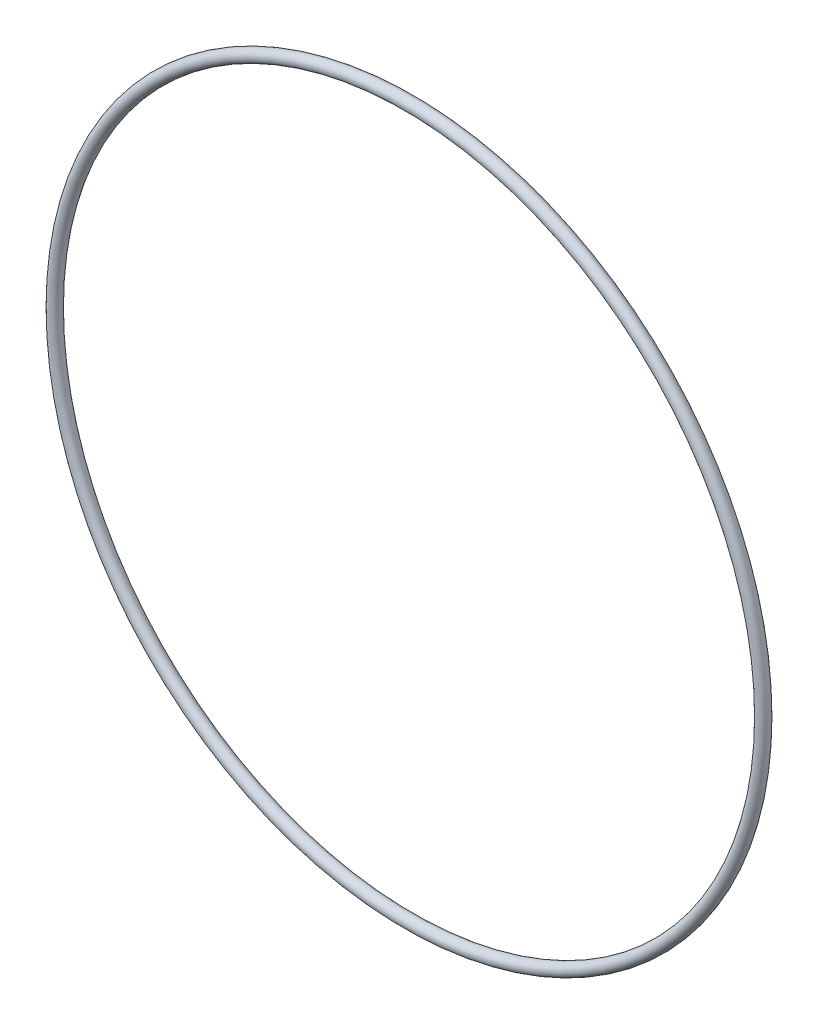
ISO-10303-21;
HEADER;
FILE_DESCRIPTION(('STEP AP214'),'2;1');
FILE_NAME('part.step','',(''),(''),'','','');
FILE_SCHEMA(('AUTOMOTIVE_DESIGN { 1 0 10303 214 1 1 1 1 }'));
ENDSEC;
DATA;
#1=APPLICATION_CONTEXT('core data for automotive mechanical design processes');
#2=APPLICATION_PROTOCOL_DEFINITION('international standard','automotive_design',2000,#1);
#3=PRODUCT_CONTEXT('',#1,'mechanical');
#4=PRODUCT('Part','Part','',(#3));
#5=PRODUCT_RELATED_PRODUCT_CATEGORY('part','',(#4));
#6=PRODUCT_DEFINITION_FORMATION('','',#4);
#7=PRODUCT_DEFINITION_CONTEXT('part definition',#1,'design');
#8=PRODUCT_DEFINITION('design','',#6,#7);
#9=PRODUCT_DEFINITION_SHAPE('','',#8);
#10=(LENGTH_UNIT() NAMED_UNIT(*) SI_UNIT(.MILLI.,.METRE.));
#11=(NAMED_UNIT(*) PLANE_ANGLE_UNIT() SI_UNIT($,.RADIAN.));
#12=(NAMED_UNIT(*) SI_UNIT($,.STERADIAN.) SOLID_ANGLE_UNIT());
#13=UNCERTAINTY_MEASURE_WITH_UNIT(LENGTH_MEASURE(1.E-05),#10,'distance_accuracy_value','');
#14=(GEOMETRIC_REPRESENTATION_CONTEXT(3) GLOBAL_UNCERTAINTY_ASSIGNED_CONTEXT((#13)) GLOBAL_UNIT_ASSIGNED_CONTEXT((#10,
#11,#12)) REPRESENTATION_CONTEXT('',''));
#15=CARTESIAN_POINT('',(0.,0.,0.));
#16=DIRECTION('',(0.,0.,1.));
#17=DIRECTION('',(1.,0.,0.));
#18=AXIS2_PLACEMENT_3D('',#15,#16,#17);
#19=CARTESIAN_POINT('',(0.,0.,0.));
#20=DIRECTION('',(0.,0.,-1.));
#21=DIRECTION('',(-1.,0.,0.));
#22=AXIS2_PLACEMENT_3D('',#19,#20,#21);
#23=TOROIDAL_SURFACE('',#22,86.5,1.5);
#24=CARTESIAN_POINT('',(-88.,0.,0.));
#25=VERTEX_POINT('',#24);
#26=VERTEX_LOOP('',#25);
#27=FACE_BOUND('',#26,.T.);
#28=ADVANCED_FACE('F30',(#27),#23,.T.);
#29=CLOSED_SHELL('',(#28));
#30=MANIFOLD_SOLID_BREP('B2',#29);
#31=ADVANCED_BREP_SHAPE_REPRESENTATION('',(#18,#30),#14);
#32=SHAPE_DEFINITION_REPRESENTATION(#9,#31);
ENDSEC;
END-ISO-10303-21;
